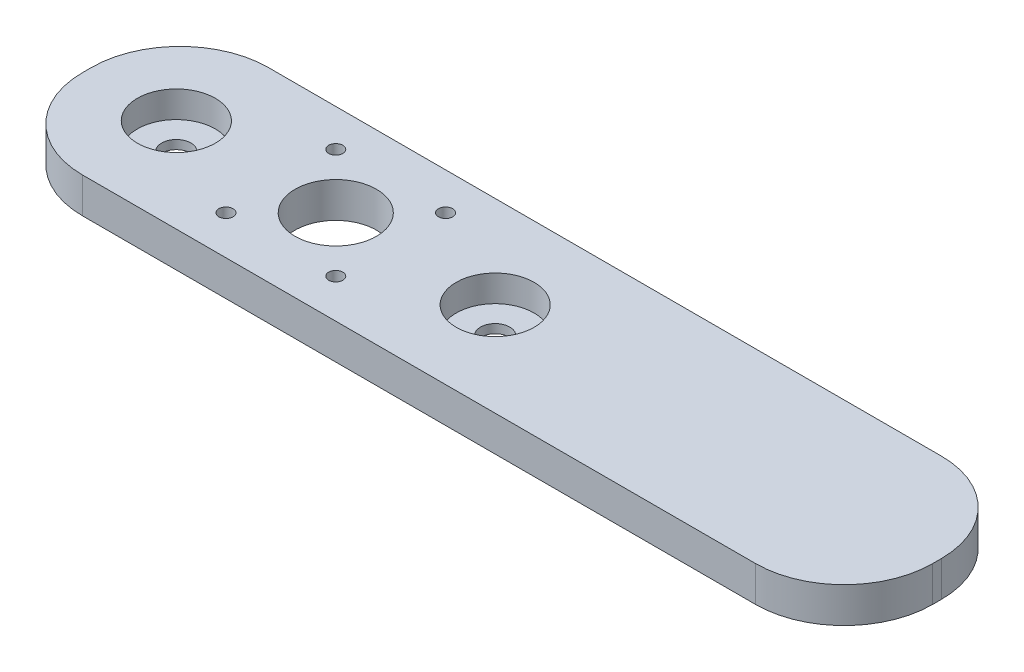
ISO-10303-21;
HEADER;
FILE_DESCRIPTION(('STEP AP214'),'2;1');
FILE_NAME('part.step','',(''),(''),'','','');
FILE_SCHEMA(('AUTOMOTIVE_DESIGN { 1 0 10303 214 1 1 1 1 }'));
ENDSEC;
DATA;
#1=APPLICATION_CONTEXT('core data for automotive mechanical design processes');
#2=APPLICATION_PROTOCOL_DEFINITION('international standard','automotive_design',2000,#1);
#3=PRODUCT_CONTEXT('',#1,'mechanical');
#4=PRODUCT('Part','Part','',(#3));
#5=PRODUCT_RELATED_PRODUCT_CATEGORY('part','',(#4));
#6=PRODUCT_DEFINITION_FORMATION('','',#4);
#7=PRODUCT_DEFINITION_CONTEXT('part definition',#1,'design');
#8=PRODUCT_DEFINITION('design','',#6,#7);
#9=PRODUCT_DEFINITION_SHAPE('','',#8);
#10=(LENGTH_UNIT() NAMED_UNIT(*) SI_UNIT(.MILLI.,.METRE.));
#11=(NAMED_UNIT(*) PLANE_ANGLE_UNIT() SI_UNIT($,.RADIAN.));
#12=(NAMED_UNIT(*) SI_UNIT($,.STERADIAN.) SOLID_ANGLE_UNIT());
#13=UNCERTAINTY_MEASURE_WITH_UNIT(LENGTH_MEASURE(1.E-05),#10,'distance_accuracy_value','');
#14=(GEOMETRIC_REPRESENTATION_CONTEXT(3) GLOBAL_UNCERTAINTY_ASSIGNED_CONTEXT((#13)) GLOBAL_UNIT_ASSIGNED_CONTEXT((#10,
#11,#12)) REPRESENTATION_CONTEXT('',''));
#15=CARTESIAN_POINT('',(0.,0.,0.));
#16=DIRECTION('',(0.,0.,1.));
#17=DIRECTION('',(1.,0.,0.));
#18=AXIS2_PLACEMENT_3D('',#15,#16,#17);
#19=CARTESIAN_POINT('',(-45.,10.,0.));
#20=DIRECTION('',(0.,1.,0.));
#21=DIRECTION('',(0.,0.,1.));
#22=AXIS2_PLACEMENT_3D('',#19,#20,#21);
#23=PLANE('',#22);
#24=DIRECTION('',(0.,0.,1.));
#25=VECTOR('',#24,1.);
#26=CARTESIAN_POINT('',(-70.,10.,1.59594559789866E-13));
#27=LINE('',#26,#25);
#28=CARTESIAN_POINT('',(-70.,10.,-0.999999999999978));
#29=VERTEX_POINT('',#28);
#30=CARTESIAN_POINT('',(-70.,10.,1.50000000000002));
#31=VERTEX_POINT('',#30);
#32=EDGE_CURVE('E129',#29,#31,#27,.T.);
#33=ORIENTED_EDGE('',*,*,#32,.T.);
#34=CARTESIAN_POINT('',(-45.,10.,1.50000000000002));
#35=DIRECTION('',(0.,1.,0.));
#36=DIRECTION('',(0.,0.,1.));
#37=AXIS2_PLACEMENT_3D('',#34,#35,#36);
#38=CIRCLE('',#37,25.);
#39=CARTESIAN_POINT('',(-45.,10.,26.5));
#40=VERTEX_POINT('',#39);
#41=EDGE_CURVE('E149',#31,#40,#38,.T.);
#42=ORIENTED_EDGE('',*,*,#41,.T.);
#43=DIRECTION('',(-1.,0.,0.));
#44=VECTOR('',#43,1.);
#45=CARTESIAN_POINT('',(0.,10.,26.5));
#46=LINE('',#45,#44);
#47=CARTESIAN_POINT('',(145.,10.,26.5));
#48=VERTEX_POINT('',#47);
#49=EDGE_CURVE('E172',#48,#40,#46,.T.);
#50=ORIENTED_EDGE('',*,*,#49,.F.);
#51=CARTESIAN_POINT('',(145.,10.,1.49999999999999));
#52=DIRECTION('',(0.,1.,0.));
#53=DIRECTION('',(0.,0.,1.));
#54=AXIS2_PLACEMENT_3D('',#51,#52,#53);
#55=CIRCLE('',#54,25.);
#56=CARTESIAN_POINT('',(170.,10.,1.49999999999999));
#57=VERTEX_POINT('',#56);
#58=EDGE_CURVE('E147',#48,#57,#55,.T.);
#59=ORIENTED_EDGE('',*,*,#58,.T.);
#60=DIRECTION('',(0.,0.,1.));
#61=VECTOR('',#60,1.);
#62=CARTESIAN_POINT('',(170.,10.,-25.));
#63=LINE('',#62,#61);
#64=CARTESIAN_POINT('',(170.,10.,-1.));
#65=VERTEX_POINT('',#64);
#66=EDGE_CURVE('E108',#65,#57,#63,.T.);
#67=ORIENTED_EDGE('',*,*,#66,.F.);
#68=CARTESIAN_POINT('',(145.,10.,-1.));
#69=DIRECTION('',(0.,1.,0.));
#70=DIRECTION('',(0.,0.,1.));
#71=AXIS2_PLACEMENT_3D('',#68,#69,#70);
#72=CIRCLE('',#71,25.);
#73=CARTESIAN_POINT('',(145.,10.,-26.));
#74=VERTEX_POINT('',#73);
#75=EDGE_CURVE('E103',#65,#74,#72,.T.);
#76=ORIENTED_EDGE('',*,*,#75,.T.);
#77=DIRECTION('',(-1.,0.,0.));
#78=VECTOR('',#77,1.);
#79=CARTESIAN_POINT('',(0.,10.,-26.));
#80=LINE('',#79,#78);
#81=CARTESIAN_POINT('',(-45.,10.,-26.));
#82=VERTEX_POINT('',#81);
#83=EDGE_CURVE('E107',#74,#82,#80,.T.);
#84=ORIENTED_EDGE('',*,*,#83,.T.);
#85=CARTESIAN_POINT('',(-45.,10.,-0.999999999999978));
#86=DIRECTION('',(0.,1.,0.));
#87=DIRECTION('',(0.,0.,1.));
#88=AXIS2_PLACEMENT_3D('',#85,#86,#87);
#89=CIRCLE('',#88,25.);
#90=EDGE_CURVE('E113',#82,#29,#89,.T.);
#91=ORIENTED_EDGE('',*,*,#90,.T.);
#92=EDGE_LOOP('',(#33,#42,#50,#59,#67,#76,#84,#91));
#93=FACE_BOUND('',#92,.T.);
#94=CARTESIAN_POINT('',(0.,10.,0.));
#95=DIRECTION('',(0.,1.,0.));
#96=DIRECTION('',(0.,0.,1.));
#97=AXIS2_PLACEMENT_3D('',#94,#95,#96);
#98=CIRCLE('',#97,11.5);
#99=CARTESIAN_POINT('',(0.,10.,11.5));
#100=VERTEX_POINT('',#99);
#101=EDGE_CURVE('E181',#100,#100,#98,.T.);
#102=ORIENTED_EDGE('',*,*,#101,.F.);
#103=EDGE_LOOP('',(#102));
#104=FACE_BOUND('',#103,.T.);
#105=CARTESIAN_POINT('',(15.5000000000009,10.,15.4999999999991));
#106=DIRECTION('',(0.,1.,0.));
#107=DIRECTION('',(0.,0.,1.));
#108=AXIS2_PLACEMENT_3D('',#105,#106,#107);
#109=CIRCLE('',#108,2.00000000000123);
#110=CARTESIAN_POINT('',(15.5000000000009,10.,17.5000000000004));
#111=VERTEX_POINT('',#110);
#112=EDGE_CURVE('E186',#111,#111,#109,.T.);
#113=ORIENTED_EDGE('',*,*,#112,.F.);
#114=EDGE_LOOP('',(#113));
#115=FACE_BOUND('',#114,.T.);
#116=CARTESIAN_POINT('',(-15.4999999999991,10.,15.5));
#117=DIRECTION('',(0.,1.,0.));
#118=DIRECTION('',(0.,0.,1.));
#119=AXIS2_PLACEMENT_3D('',#116,#117,#118);
#120=CIRCLE('',#119,2.00000000000048);
#121=CARTESIAN_POINT('',(-15.4999999999991,10.,17.5000000000005));
#122=VERTEX_POINT('',#121);
#123=EDGE_CURVE('E192',#122,#122,#120,.T.);
#124=ORIENTED_EDGE('',*,*,#123,.F.);
#125=EDGE_LOOP('',(#124));
#126=FACE_BOUND('',#125,.T.);
#127=CARTESIAN_POINT('',(-15.5,10.,-15.5));
#128=DIRECTION('',(0.,1.,0.));
#129=DIRECTION('',(0.,0.,1.));
#130=AXIS2_PLACEMENT_3D('',#127,#128,#129);
#131=CIRCLE('',#130,2.00000000000001);
#132=CARTESIAN_POINT('',(-15.5,10.,-13.5));
#133=VERTEX_POINT('',#132);
#134=EDGE_CURVE('E198',#133,#133,#131,.T.);
#135=ORIENTED_EDGE('',*,*,#134,.F.);
#136=EDGE_LOOP('',(#135));
#137=FACE_BOUND('',#136,.T.);
#138=CARTESIAN_POINT('',(15.5,10.,-15.5000000000009));
#139=DIRECTION('',(0.,1.,0.));
#140=DIRECTION('',(0.,0.,1.));
#141=AXIS2_PLACEMENT_3D('',#138,#139,#140);
#142=CIRCLE('',#141,2.00000000000091);
#143=CARTESIAN_POINT('',(15.5,10.,-13.5));
#144=VERTEX_POINT('',#143);
#145=EDGE_CURVE('E204',#144,#144,#142,.T.);
#146=ORIENTED_EDGE('',*,*,#145,.F.);
#147=EDGE_LOOP('',(#146));
#148=FACE_BOUND('',#147,.T.);
#149=CARTESIAN_POINT('',(-45.,10.,0.));
#150=DIRECTION('',(0.,1.,0.));
#151=DIRECTION('',(0.,0.,-1.));
#152=AXIS2_PLACEMENT_3D('',#149,#150,#151);
#153=CIRCLE('',#152,11.);
#154=CARTESIAN_POINT('',(-45.,10.,-11.));
#155=VERTEX_POINT('',#154);
#156=EDGE_CURVE('E169',#155,#155,#153,.T.);
#157=ORIENTED_EDGE('',*,*,#156,.F.);
#158=EDGE_LOOP('',(#157));
#159=FACE_BOUND('',#158,.T.);
#160=CARTESIAN_POINT('',(45.,10.,0.));
#161=DIRECTION('',(0.,1.,0.));
#162=DIRECTION('',(0.,0.,1.));
#163=AXIS2_PLACEMENT_3D('',#160,#161,#162);
#164=CIRCLE('',#163,11.);
#165=CARTESIAN_POINT('',(45.,10.,11.));
#166=VERTEX_POINT('',#165);
#167=EDGE_CURVE('E230',#166,#166,#164,.T.);
#168=ORIENTED_EDGE('',*,*,#167,.F.);
#169=EDGE_LOOP('',(#168));
#170=FACE_BOUND('',#169,.T.);
#171=ADVANCED_FACE('F36',(#93,#104,#115,#126,#137,#148,#159,#170),#23,.T.);
#172=CARTESIAN_POINT('',(-45.,0.,0.));
#173=DIRECTION('',(0.,1.,0.));
#174=DIRECTION('',(0.,0.,1.));
#175=AXIS2_PLACEMENT_3D('',#172,#173,#174);
#176=PLANE('',#175);
#177=DIRECTION('',(-1.,0.,0.));
#178=VECTOR('',#177,1.);
#179=CARTESIAN_POINT('',(0.,0.,26.5));
#180=LINE('',#179,#178);
#181=CARTESIAN_POINT('',(145.,0.,26.5));
#182=VERTEX_POINT('',#181);
#183=CARTESIAN_POINT('',(-45.,0.,26.5));
#184=VERTEX_POINT('',#183);
#185=EDGE_CURVE('E124',#182,#184,#180,.T.);
#186=ORIENTED_EDGE('',*,*,#185,.T.);
#187=CARTESIAN_POINT('',(-45.,0.,1.50000000000002));
#188=DIRECTION('',(0.,1.,0.));
#189=DIRECTION('',(0.,0.,1.));
#190=AXIS2_PLACEMENT_3D('',#187,#188,#189);
#191=CIRCLE('',#190,25.);
#192=CARTESIAN_POINT('',(-70.,0.,1.50000000000002));
#193=VERTEX_POINT('',#192);
#194=EDGE_CURVE('E44',#184,#193,#191,.F.);
#195=ORIENTED_EDGE('',*,*,#194,.T.);
#196=DIRECTION('',(0.,0.,1.));
#197=VECTOR('',#196,1.);
#198=CARTESIAN_POINT('',(-70.,0.,27.));
#199=LINE('',#198,#197);
#200=CARTESIAN_POINT('',(-70.,0.,-0.999999999999977));
#201=VERTEX_POINT('',#200);
#202=EDGE_CURVE('E132',#201,#193,#199,.T.);
#203=ORIENTED_EDGE('',*,*,#202,.F.);
#204=CARTESIAN_POINT('',(-45.,0.,-0.999999999999978));
#205=DIRECTION('',(0.,1.,0.));
#206=DIRECTION('',(0.,0.,1.));
#207=AXIS2_PLACEMENT_3D('',#204,#205,#206);
#208=CIRCLE('',#207,25.);
#209=CARTESIAN_POINT('',(-45.,0.,-26.));
#210=VERTEX_POINT('',#209);
#211=EDGE_CURVE('E140',#201,#210,#208,.F.);
#212=ORIENTED_EDGE('',*,*,#211,.T.);
#213=DIRECTION('',(-1.,0.,0.));
#214=VECTOR('',#213,1.);
#215=CARTESIAN_POINT('',(0.,0.,-26.));
#216=LINE('',#215,#214);
#217=CARTESIAN_POINT('',(145.,0.,-26.));
#218=VERTEX_POINT('',#217);
#219=EDGE_CURVE('E123',#218,#210,#216,.T.);
#220=ORIENTED_EDGE('',*,*,#219,.F.);
#221=CARTESIAN_POINT('',(145.,0.,-1.));
#222=DIRECTION('',(0.,1.,0.));
#223=DIRECTION('',(0.,0.,1.));
#224=AXIS2_PLACEMENT_3D('',#221,#222,#223);
#225=CIRCLE('',#224,25.);
#226=CARTESIAN_POINT('',(170.,0.,-1.));
#227=VERTEX_POINT('',#226);
#228=EDGE_CURVE('E128',#218,#227,#225,.F.);
#229=ORIENTED_EDGE('',*,*,#228,.T.);
#230=DIRECTION('',(0.,0.,1.));
#231=VECTOR('',#230,1.);
#232=CARTESIAN_POINT('',(170.,0.,-25.));
#233=LINE('',#232,#231);
#234=CARTESIAN_POINT('',(170.,0.,1.49999999999999));
#235=VERTEX_POINT('',#234);
#236=EDGE_CURVE('E178',#227,#235,#233,.T.);
#237=ORIENTED_EDGE('',*,*,#236,.T.);
#238=CARTESIAN_POINT('',(145.,0.,1.49999999999999));
#239=DIRECTION('',(0.,1.,0.));
#240=DIRECTION('',(0.,0.,1.));
#241=AXIS2_PLACEMENT_3D('',#238,#239,#240);
#242=CIRCLE('',#241,25.);
#243=EDGE_CURVE('E155',#235,#182,#242,.F.);
#244=ORIENTED_EDGE('',*,*,#243,.T.);
#245=EDGE_LOOP('',(#186,#195,#203,#212,#220,#229,#237,#244));
#246=FACE_BOUND('',#245,.T.);
#247=CARTESIAN_POINT('',(0.,0.,0.));
#248=DIRECTION('',(0.,1.,0.));
#249=DIRECTION('',(0.,0.,1.));
#250=AXIS2_PLACEMENT_3D('',#247,#248,#249);
#251=CIRCLE('',#250,11.5);
#252=CARTESIAN_POINT('',(0.,0.,11.5));
#253=VERTEX_POINT('',#252);
#254=EDGE_CURVE('E183',#253,#253,#251,.T.);
#255=ORIENTED_EDGE('',*,*,#254,.T.);
#256=EDGE_LOOP('',(#255));
#257=FACE_BOUND('',#256,.T.);
#258=CARTESIAN_POINT('',(15.5000000000009,0.,15.4999999999991));
#259=DIRECTION('',(0.,1.,0.));
#260=DIRECTION('',(0.,0.,1.));
#261=AXIS2_PLACEMENT_3D('',#258,#259,#260);
#262=CIRCLE('',#261,2.00000000000123);
#263=CARTESIAN_POINT('',(15.5000000000009,0.,17.5000000000004));
#264=VERTEX_POINT('',#263);
#265=EDGE_CURVE('E189',#264,#264,#262,.T.);
#266=ORIENTED_EDGE('',*,*,#265,.T.);
#267=EDGE_LOOP('',(#266));
#268=FACE_BOUND('',#267,.T.);
#269=CARTESIAN_POINT('',(-15.4999999999991,0.,15.5));
#270=DIRECTION('',(0.,1.,0.));
#271=DIRECTION('',(0.,0.,1.));
#272=AXIS2_PLACEMENT_3D('',#269,#270,#271);
#273=CIRCLE('',#272,2.00000000000048);
#274=CARTESIAN_POINT('',(-15.4999999999991,0.,17.5000000000005));
#275=VERTEX_POINT('',#274);
#276=EDGE_CURVE('E195',#275,#275,#273,.T.);
#277=ORIENTED_EDGE('',*,*,#276,.T.);
#278=EDGE_LOOP('',(#277));
#279=FACE_BOUND('',#278,.T.);
#280=CARTESIAN_POINT('',(-15.5,0.,-15.5));
#281=DIRECTION('',(0.,1.,0.));
#282=DIRECTION('',(0.,0.,1.));
#283=AXIS2_PLACEMENT_3D('',#280,#281,#282);
#284=CIRCLE('',#283,2.00000000000001);
#285=CARTESIAN_POINT('',(-15.5,0.,-13.5));
#286=VERTEX_POINT('',#285);
#287=EDGE_CURVE('E201',#286,#286,#284,.T.);
#288=ORIENTED_EDGE('',*,*,#287,.T.);
#289=EDGE_LOOP('',(#288));
#290=FACE_BOUND('',#289,.T.);
#291=CARTESIAN_POINT('',(15.5,0.,-15.5000000000009));
#292=DIRECTION('',(0.,1.,0.));
#293=DIRECTION('',(0.,0.,1.));
#294=AXIS2_PLACEMENT_3D('',#291,#292,#293);
#295=CIRCLE('',#294,2.00000000000091);
#296=CARTESIAN_POINT('',(15.5,0.,-13.5));
#297=VERTEX_POINT('',#296);
#298=EDGE_CURVE('E207',#297,#297,#295,.T.);
#299=ORIENTED_EDGE('',*,*,#298,.T.);
#300=EDGE_LOOP('',(#299));
#301=FACE_BOUND('',#300,.T.);
#302=CARTESIAN_POINT('',(45.,0.,0.));
#303=DIRECTION('',(0.,-1.,0.));
#304=DIRECTION('',(0.,0.,-1.));
#305=AXIS2_PLACEMENT_3D('',#302,#303,#304);
#306=CIRCLE('',#305,4.125);
#307=CARTESIAN_POINT('',(45.,0.,-4.125));
#308=VERTEX_POINT('',#307);
#309=EDGE_CURVE('E221',#308,#308,#306,.T.);
#310=ORIENTED_EDGE('',*,*,#309,.F.);
#311=EDGE_LOOP('',(#310));
#312=FACE_BOUND('',#311,.T.);
#313=CARTESIAN_POINT('',(-45.,0.,0.));
#314=DIRECTION('',(0.,-1.,0.));
#315=DIRECTION('',(0.,0.,-1.));
#316=AXIS2_PLACEMENT_3D('',#313,#314,#315);
#317=CIRCLE('',#316,4.125);
#318=CARTESIAN_POINT('',(-45.,0.,-4.125));
#319=VERTEX_POINT('',#318);
#320=EDGE_CURVE('E210',#319,#319,#317,.T.);
#321=ORIENTED_EDGE('',*,*,#320,.F.);
#322=EDGE_LOOP('',(#321));
#323=FACE_BOUND('',#322,.T.);
#324=ADVANCED_FACE('F160',(#246,#257,#268,#279,#290,#301,#312,#323),#176,.F.);
#325=CARTESIAN_POINT('',(-45.,10.,0.));
#326=DIRECTION('',(0.,-1.,0.));
#327=DIRECTION('',(0.,0.,-1.));
#328=AXIS2_PLACEMENT_3D('',#325,#326,#327);
#329=CYLINDRICAL_SURFACE('',#328,11.);
#330=ORIENTED_EDGE('',*,*,#156,.T.);
#331=EDGE_LOOP('',(#330));
#332=FACE_BOUND('',#331,.T.);
#333=CARTESIAN_POINT('',(-45.,2.5,0.));
#334=DIRECTION('',(0.,-1.,0.));
#335=DIRECTION('',(0.,0.,-1.));
#336=AXIS2_PLACEMENT_3D('',#333,#334,#335);
#337=CIRCLE('',#336,11.);
#338=CARTESIAN_POINT('',(-45.,2.5,-11.));
#339=VERTEX_POINT('',#338);
#340=EDGE_CURVE('E216',#339,#339,#337,.T.);
#341=ORIENTED_EDGE('',*,*,#340,.T.);
#342=EDGE_LOOP('',(#341));
#343=FACE_BOUND('',#342,.T.);
#344=ADVANCED_FACE('F236',(#332,#343),#329,.F.);
#345=CARTESIAN_POINT('',(45.,10.,0.));
#346=DIRECTION('',(0.,-1.,0.));
#347=DIRECTION('',(0.,0.,-1.));
#348=AXIS2_PLACEMENT_3D('',#345,#346,#347);
#349=CYLINDRICAL_SURFACE('',#348,11.);
#350=ORIENTED_EDGE('',*,*,#167,.T.);
#351=EDGE_LOOP('',(#350));
#352=FACE_BOUND('',#351,.T.);
#353=CARTESIAN_POINT('',(45.,2.5,0.));
#354=DIRECTION('',(0.,-1.,0.));
#355=DIRECTION('',(0.,0.,-1.));
#356=AXIS2_PLACEMENT_3D('',#353,#354,#355);
#357=CIRCLE('',#356,11.);
#358=CARTESIAN_POINT('',(45.,2.5,-11.));
#359=VERTEX_POINT('',#358);
#360=EDGE_CURVE('E225',#359,#359,#357,.T.);
#361=ORIENTED_EDGE('',*,*,#360,.T.);
#362=EDGE_LOOP('',(#361));
#363=FACE_BOUND('',#362,.T.);
#364=ADVANCED_FACE('F244',(#352,#363),#349,.F.);
#365=CARTESIAN_POINT('',(-70.,10.,27.));
#366=DIRECTION('',(1.,0.,0.));
#367=DIRECTION('',(0.,0.,-1.));
#368=AXIS2_PLACEMENT_3D('',#365,#366,#367);
#369=PLANE('',#368);
#370=ORIENTED_EDGE('',*,*,#202,.T.);
#371=DIRECTION('',(0.,1.,0.));
#372=VECTOR('',#371,1.);
#373=CARTESIAN_POINT('',(-70.,10.,1.50000000000002));
#374=LINE('',#373,#372);
#375=EDGE_CURVE('E144',#193,#31,#374,.T.);
#376=ORIENTED_EDGE('',*,*,#375,.T.);
#377=ORIENTED_EDGE('',*,*,#32,.F.);
#378=DIRECTION('',(0.,1.,0.));
#379=VECTOR('',#378,1.);
#380=CARTESIAN_POINT('',(-70.,0.,-0.999999999999978));
#381=LINE('',#380,#379);
#382=EDGE_CURVE('E137',#29,#201,#381,.F.);
#383=ORIENTED_EDGE('',*,*,#382,.T.);
#384=EDGE_LOOP('',(#370,#376,#377,#383));
#385=FACE_BOUND('',#384,.T.);
#386=ADVANCED_FACE('F166',(#385),#369,.F.);
#387=CARTESIAN_POINT('',(45.,2.5,0.));
#388=DIRECTION('',(0.,-1.,0.));
#389=DIRECTION('',(0.,0.,-1.));
#390=AXIS2_PLACEMENT_3D('',#387,#388,#389);
#391=PLANE('',#390);
#392=CARTESIAN_POINT('',(45.,2.5,0.));
#393=DIRECTION('',(0.,-1.,0.));
#394=DIRECTION('',(0.,0.,-1.));
#395=AXIS2_PLACEMENT_3D('',#392,#393,#394);
#396=CIRCLE('',#395,4.125);
#397=CARTESIAN_POINT('',(45.,2.5,-4.125));
#398=VERTEX_POINT('',#397);
#399=EDGE_CURVE('E222',#398,#398,#396,.T.);
#400=ORIENTED_EDGE('',*,*,#399,.T.);
#401=EDGE_LOOP('',(#400));
#402=FACE_BOUND('',#401,.T.);
#403=ORIENTED_EDGE('',*,*,#360,.F.);
#404=EDGE_LOOP('',(#403));
#405=FACE_BOUND('',#404,.T.);
#406=ADVANCED_FACE('F250',(#402,#405),#391,.F.);
#407=CARTESIAN_POINT('',(45.,2.5,0.));
#408=DIRECTION('',(0.,-1.,0.));
#409=DIRECTION('',(0.,0.,-1.));
#410=AXIS2_PLACEMENT_3D('',#407,#408,#409);
#411=CYLINDRICAL_SURFACE('',#410,4.125);
#412=ORIENTED_EDGE('',*,*,#399,.F.);
#413=EDGE_LOOP('',(#412));
#414=FACE_BOUND('',#413,.T.);
#415=ORIENTED_EDGE('',*,*,#309,.T.);
#416=EDGE_LOOP('',(#415));
#417=FACE_BOUND('',#416,.T.);
#418=ADVANCED_FACE('F252',(#414,#417),#411,.F.);
#419=CARTESIAN_POINT('',(-45.,2.5,0.));
#420=DIRECTION('',(0.,-1.,0.));
#421=DIRECTION('',(0.,0.,-1.));
#422=AXIS2_PLACEMENT_3D('',#419,#420,#421);
#423=PLANE('',#422);
#424=CARTESIAN_POINT('',(-45.,2.5,0.));
#425=DIRECTION('',(0.,-1.,0.));
#426=DIRECTION('',(0.,0.,-1.));
#427=AXIS2_PLACEMENT_3D('',#424,#425,#426);
#428=CIRCLE('',#427,4.125);
#429=CARTESIAN_POINT('',(-45.,2.5,-4.125));
#430=VERTEX_POINT('',#429);
#431=EDGE_CURVE('E213',#430,#430,#428,.T.);
#432=ORIENTED_EDGE('',*,*,#431,.T.);
#433=EDGE_LOOP('',(#432));
#434=FACE_BOUND('',#433,.T.);
#435=ORIENTED_EDGE('',*,*,#340,.F.);
#436=EDGE_LOOP('',(#435));
#437=FACE_BOUND('',#436,.T.);
#438=ADVANCED_FACE('F259',(#434,#437),#423,.F.);
#439=CARTESIAN_POINT('',(-45.,2.5,0.));
#440=DIRECTION('',(0.,-1.,0.));
#441=DIRECTION('',(0.,0.,-1.));
#442=AXIS2_PLACEMENT_3D('',#439,#440,#441);
#443=CYLINDRICAL_SURFACE('',#442,4.125);
#444=ORIENTED_EDGE('',*,*,#431,.F.);
#445=EDGE_LOOP('',(#444));
#446=FACE_BOUND('',#445,.T.);
#447=ORIENTED_EDGE('',*,*,#320,.T.);
#448=EDGE_LOOP('',(#447));
#449=FACE_BOUND('',#448,.T.);
#450=ADVANCED_FACE('F308',(#446,#449),#443,.F.);
#451=CARTESIAN_POINT('',(15.5,0.,-15.5000000000009));
#452=DIRECTION('',(0.,1.,0.));
#453=DIRECTION('',(0.,0.,1.));
#454=AXIS2_PLACEMENT_3D('',#451,#452,#453);
#455=CYLINDRICAL_SURFACE('',#454,2.00000000000091);
#456=ORIENTED_EDGE('',*,*,#298,.F.);
#457=EDGE_LOOP('',(#456));
#458=FACE_BOUND('',#457,.T.);
#459=ORIENTED_EDGE('',*,*,#145,.T.);
#460=EDGE_LOOP('',(#459));
#461=FACE_BOUND('',#460,.T.);
#462=ADVANCED_FACE('F304',(#458,#461),#455,.F.);
#463=CARTESIAN_POINT('',(-15.5,0.,-15.5));
#464=DIRECTION('',(0.,1.,0.));
#465=DIRECTION('',(0.,0.,1.));
#466=AXIS2_PLACEMENT_3D('',#463,#464,#465);
#467=CYLINDRICAL_SURFACE('',#466,2.00000000000001);
#468=ORIENTED_EDGE('',*,*,#287,.F.);
#469=EDGE_LOOP('',(#468));
#470=FACE_BOUND('',#469,.T.);
#471=ORIENTED_EDGE('',*,*,#134,.T.);
#472=EDGE_LOOP('',(#471));
#473=FACE_BOUND('',#472,.T.);
#474=ADVANCED_FACE('F300',(#470,#473),#467,.F.);
#475=CARTESIAN_POINT('',(-15.4999999999991,0.,15.5));
#476=DIRECTION('',(0.,1.,0.));
#477=DIRECTION('',(0.,0.,1.));
#478=AXIS2_PLACEMENT_3D('',#475,#476,#477);
#479=CYLINDRICAL_SURFACE('',#478,2.00000000000048);
#480=ORIENTED_EDGE('',*,*,#276,.F.);
#481=EDGE_LOOP('',(#480));
#482=FACE_BOUND('',#481,.T.);
#483=ORIENTED_EDGE('',*,*,#123,.T.);
#484=EDGE_LOOP('',(#483));
#485=FACE_BOUND('',#484,.T.);
#486=ADVANCED_FACE('F296',(#482,#485),#479,.F.);
#487=CARTESIAN_POINT('',(15.5000000000009,0.,15.4999999999991));
#488=DIRECTION('',(0.,1.,0.));
#489=DIRECTION('',(0.,0.,1.));
#490=AXIS2_PLACEMENT_3D('',#487,#488,#489);
#491=CYLINDRICAL_SURFACE('',#490,2.00000000000123);
#492=ORIENTED_EDGE('',*,*,#265,.F.);
#493=EDGE_LOOP('',(#492));
#494=FACE_BOUND('',#493,.T.);
#495=ORIENTED_EDGE('',*,*,#112,.T.);
#496=EDGE_LOOP('',(#495));
#497=FACE_BOUND('',#496,.T.);
#498=ADVANCED_FACE('F292',(#494,#497),#491,.F.);
#499=CARTESIAN_POINT('',(0.,0.,0.));
#500=DIRECTION('',(0.,1.,0.));
#501=DIRECTION('',(0.,0.,1.));
#502=AXIS2_PLACEMENT_3D('',#499,#500,#501);
#503=CYLINDRICAL_SURFACE('',#502,11.5);
#504=ORIENTED_EDGE('',*,*,#254,.F.);
#505=EDGE_LOOP('',(#504));
#506=FACE_BOUND('',#505,.T.);
#507=ORIENTED_EDGE('',*,*,#101,.T.);
#508=EDGE_LOOP('',(#507));
#509=FACE_BOUND('',#508,.T.);
#510=ADVANCED_FACE('F289',(#506,#509),#503,.F.);
#511=CARTESIAN_POINT('',(170.,10.,-25.));
#512=DIRECTION('',(1.,0.,0.));
#513=DIRECTION('',(0.,0.,-1.));
#514=AXIS2_PLACEMENT_3D('',#511,#512,#513);
#515=PLANE('',#514);
#516=ORIENTED_EDGE('',*,*,#66,.T.);
#517=DIRECTION('',(0.,1.,0.));
#518=VECTOR('',#517,1.);
#519=CARTESIAN_POINT('',(170.,0.,1.49999999999999));
#520=LINE('',#519,#518);
#521=EDGE_CURVE('E11',#57,#235,#520,.F.);
#522=ORIENTED_EDGE('',*,*,#521,.T.);
#523=ORIENTED_EDGE('',*,*,#236,.F.);
#524=DIRECTION('',(0.,1.,0.));
#525=VECTOR('',#524,1.);
#526=CARTESIAN_POINT('',(170.,10.,-1.));
#527=LINE('',#526,#525);
#528=EDGE_CURVE('E142',#227,#65,#527,.T.);
#529=ORIENTED_EDGE('',*,*,#528,.T.);
#530=EDGE_LOOP('',(#516,#522,#523,#529));
#531=FACE_BOUND('',#530,.T.);
#532=ADVANCED_FACE('F286',(#531),#515,.T.);
#533=CARTESIAN_POINT('',(0.,0.,-26.));
#534=DIRECTION('',(0.,0.,-1.));
#535=DIRECTION('',(-1.,0.,0.));
#536=AXIS2_PLACEMENT_3D('',#533,#534,#535);
#537=PLANE('',#536);
#538=ORIENTED_EDGE('',*,*,#219,.T.);
#539=DIRECTION('',(0.,1.,0.));
#540=VECTOR('',#539,1.);
#541=CARTESIAN_POINT('',(-45.,10.,-26.));
#542=LINE('',#541,#540);
#543=EDGE_CURVE('E114',#210,#82,#542,.T.);
#544=ORIENTED_EDGE('',*,*,#543,.T.);
#545=ORIENTED_EDGE('',*,*,#83,.F.);
#546=DIRECTION('',(0.,1.,0.));
#547=VECTOR('',#546,1.);
#548=CARTESIAN_POINT('',(145.,0.,-26.));
#549=LINE('',#548,#547);
#550=EDGE_CURVE('E120',#74,#218,#549,.F.);
#551=ORIENTED_EDGE('',*,*,#550,.T.);
#552=EDGE_LOOP('',(#538,#544,#545,#551));
#553=FACE_BOUND('',#552,.T.);
#554=ADVANCED_FACE('F119',(#553),#537,.T.);
#555=CARTESIAN_POINT('',(-45.,0.,-0.999999999999978));
#556=DIRECTION('',(0.,-1.,0.));
#557=DIRECTION('',(0.,0.,-1.));
#558=AXIS2_PLACEMENT_3D('',#555,#556,#557);
#559=CYLINDRICAL_SURFACE('',#558,25.);
#560=ORIENTED_EDGE('',*,*,#211,.F.);
#561=ORIENTED_EDGE('',*,*,#382,.F.);
#562=ORIENTED_EDGE('',*,*,#90,.F.);
#563=ORIENTED_EDGE('',*,*,#543,.F.);
#564=EDGE_LOOP('',(#560,#561,#562,#563));
#565=FACE_BOUND('',#564,.T.);
#566=ADVANCED_FACE('F269',(#565),#559,.T.);
#567=CARTESIAN_POINT('',(145.,10.,-1.));
#568=DIRECTION('',(0.,1.,0.));
#569=DIRECTION('',(0.,0.,1.));
#570=AXIS2_PLACEMENT_3D('',#567,#568,#569);
#571=CYLINDRICAL_SURFACE('',#570,25.);
#572=ORIENTED_EDGE('',*,*,#228,.F.);
#573=ORIENTED_EDGE('',*,*,#550,.F.);
#574=ORIENTED_EDGE('',*,*,#75,.F.);
#575=ORIENTED_EDGE('',*,*,#528,.F.);
#576=EDGE_LOOP('',(#572,#573,#574,#575));
#577=FACE_BOUND('',#576,.T.);
#578=ADVANCED_FACE('F127',(#577),#571,.T.);
#579=CARTESIAN_POINT('',(0.,0.,26.5));
#580=DIRECTION('',(0.,0.,-1.));
#581=DIRECTION('',(-1.,0.,0.));
#582=AXIS2_PLACEMENT_3D('',#579,#580,#581);
#583=PLANE('',#582);
#584=ORIENTED_EDGE('',*,*,#49,.T.);
#585=DIRECTION('',(0.,1.,0.));
#586=VECTOR('',#585,1.);
#587=CARTESIAN_POINT('',(-45.,0.,26.5));
#588=LINE('',#587,#586);
#589=EDGE_CURVE('E57',#40,#184,#588,.F.);
#590=ORIENTED_EDGE('',*,*,#589,.T.);
#591=ORIENTED_EDGE('',*,*,#185,.F.);
#592=DIRECTION('',(0.,1.,0.));
#593=VECTOR('',#592,1.);
#594=CARTESIAN_POINT('',(145.,10.,26.5));
#595=LINE('',#594,#593);
#596=EDGE_CURVE('E151',#182,#48,#595,.T.);
#597=ORIENTED_EDGE('',*,*,#596,.T.);
#598=EDGE_LOOP('',(#584,#590,#591,#597));
#599=FACE_BOUND('',#598,.T.);
#600=ADVANCED_FACE('F173',(#599),#583,.F.);
#601=CARTESIAN_POINT('',(-45.,10.,1.50000000000002));
#602=DIRECTION('',(0.,1.,0.));
#603=DIRECTION('',(0.,0.,1.));
#604=AXIS2_PLACEMENT_3D('',#601,#602,#603);
#605=CYLINDRICAL_SURFACE('',#604,25.);
#606=ORIENTED_EDGE('',*,*,#194,.F.);
#607=ORIENTED_EDGE('',*,*,#589,.F.);
#608=ORIENTED_EDGE('',*,*,#41,.F.);
#609=ORIENTED_EDGE('',*,*,#375,.F.);
#610=EDGE_LOOP('',(#606,#607,#608,#609));
#611=FACE_BOUND('',#610,.T.);
#612=ADVANCED_FACE('F170',(#611),#605,.T.);
#613=CARTESIAN_POINT('',(145.,0.,1.49999999999999));
#614=DIRECTION('',(0.,-1.,0.));
#615=DIRECTION('',(0.,0.,-1.));
#616=AXIS2_PLACEMENT_3D('',#613,#614,#615);
#617=CYLINDRICAL_SURFACE('',#616,25.);
#618=ORIENTED_EDGE('',*,*,#243,.F.);
#619=ORIENTED_EDGE('',*,*,#521,.F.);
#620=ORIENTED_EDGE('',*,*,#58,.F.);
#621=ORIENTED_EDGE('',*,*,#596,.F.);
#622=EDGE_LOOP('',(#618,#619,#620,#621));
#623=FACE_BOUND('',#622,.T.);
#624=ADVANCED_FACE('F38',(#623),#617,.T.);
#625=CLOSED_SHELL('',(#171,#324,#344,#364,#386,#406,#418,#438,#450,#462,#474,#486,#498,#510,
#532,#554,#566,#578,#600,#612,#624));
#626=MANIFOLD_SOLID_BREP('B2',#625);
#627=ADVANCED_BREP_SHAPE_REPRESENTATION('',(#18,#626),#14);
#628=SHAPE_DEFINITION_REPRESENTATION(#9,#627);
ENDSEC;
END-ISO-10303-21;
